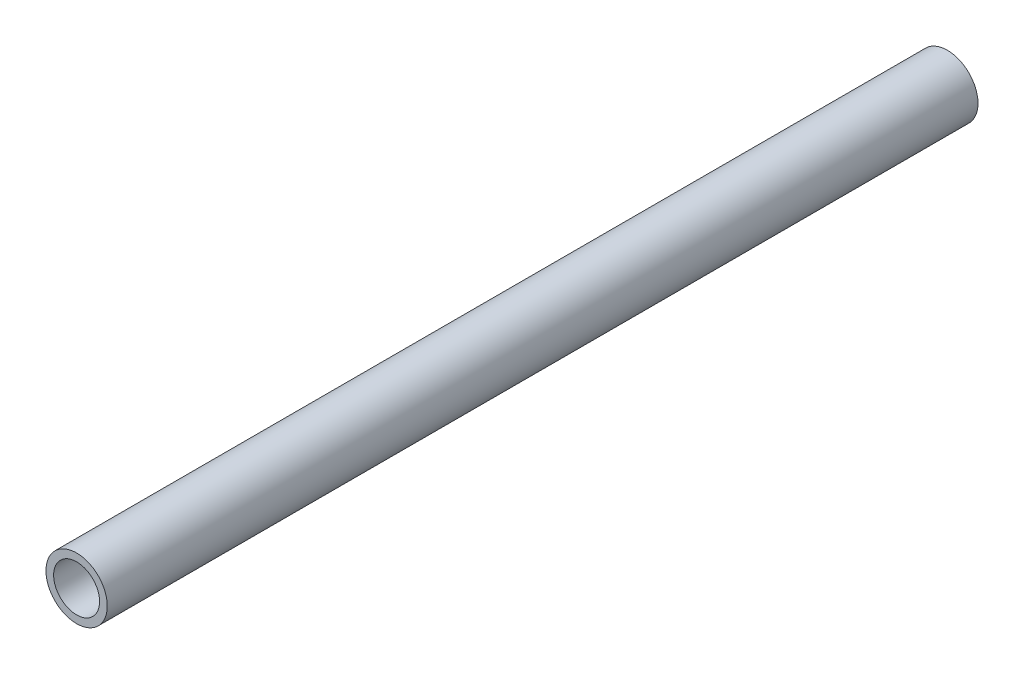
ISO-10303-21;
HEADER;
FILE_DESCRIPTION(('STEP AP214'),'2;1');
FILE_NAME('part.step','',(''),(''),'','','');
FILE_SCHEMA(('AUTOMOTIVE_DESIGN { 1 0 10303 214 1 1 1 1 }'));
ENDSEC;
DATA;
#1=APPLICATION_CONTEXT('core data for automotive mechanical design processes');
#2=APPLICATION_PROTOCOL_DEFINITION('international standard','automotive_design',2000,#1);
#3=PRODUCT_CONTEXT('',#1,'mechanical');
#4=PRODUCT('Part','Part','',(#3));
#5=PRODUCT_RELATED_PRODUCT_CATEGORY('part','',(#4));
#6=PRODUCT_DEFINITION_FORMATION('','',#4);
#7=PRODUCT_DEFINITION_CONTEXT('part definition',#1,'design');
#8=PRODUCT_DEFINITION('design','',#6,#7);
#9=PRODUCT_DEFINITION_SHAPE('','',#8);
#10=(LENGTH_UNIT() NAMED_UNIT(*) SI_UNIT(.MILLI.,.METRE.));
#11=(NAMED_UNIT(*) PLANE_ANGLE_UNIT() SI_UNIT($,.RADIAN.));
#12=(NAMED_UNIT(*) SI_UNIT($,.STERADIAN.) SOLID_ANGLE_UNIT());
#13=UNCERTAINTY_MEASURE_WITH_UNIT(LENGTH_MEASURE(1.E-05),#10,'distance_accuracy_value','');
#14=(GEOMETRIC_REPRESENTATION_CONTEXT(3) GLOBAL_UNCERTAINTY_ASSIGNED_CONTEXT((#13)) GLOBAL_UNIT_ASSIGNED_CONTEXT((#10,
#11,#12)) REPRESENTATION_CONTEXT('',''));
#15=CARTESIAN_POINT('',(0.,0.,0.));
#16=DIRECTION('',(0.,0.,1.));
#17=DIRECTION('',(1.,0.,0.));
#18=AXIS2_PLACEMENT_3D('',#15,#16,#17);
#19=CARTESIAN_POINT('',(0.,0.,180.366666666667));
#20=DIRECTION('',(0.,0.,1.));
#21=DIRECTION('',(1.,0.,0.));
#22=AXIS2_PLACEMENT_3D('',#19,#20,#21);
#23=PLANE('',#22);
#24=CARTESIAN_POINT('',(0.,0.,180.366666666667));
#25=DIRECTION('',(0.,0.,1.));
#26=DIRECTION('',(1.,0.,0.));
#27=AXIS2_PLACEMENT_3D('',#24,#25,#26);
#28=CIRCLE('',#27,6.35);
#29=CARTESIAN_POINT('',(6.35,0.,180.366666666667));
#30=VERTEX_POINT('',#29);
#31=EDGE_CURVE('E10',#30,#30,#28,.T.);
#32=ORIENTED_EDGE('',*,*,#31,.T.);
#33=EDGE_LOOP('',(#32));
#34=FACE_BOUND('',#33,.T.);
#35=CARTESIAN_POINT('',(0.,0.,180.366666666667));
#36=DIRECTION('',(0.,0.,1.));
#37=DIRECTION('',(1.,0.,0.));
#38=AXIS2_PLACEMENT_3D('',#35,#36,#37);
#39=CIRCLE('',#38,4.7625);
#40=CARTESIAN_POINT('',(4.7625,0.,180.366666666667));
#41=VERTEX_POINT('',#40);
#42=EDGE_CURVE('E43',#41,#41,#39,.T.);
#43=ORIENTED_EDGE('',*,*,#42,.F.);
#44=EDGE_LOOP('',(#43));
#45=FACE_BOUND('',#44,.T.);
#46=ADVANCED_FACE('F32',(#34,#45),#23,.T.);
#47=CARTESIAN_POINT('',(0.,0.,0.));
#48=DIRECTION('',(0.,0.,1.));
#49=DIRECTION('',(1.,0.,0.));
#50=AXIS2_PLACEMENT_3D('',#47,#48,#49);
#51=PLANE('',#50);
#52=CARTESIAN_POINT('',(0.,0.,0.));
#53=DIRECTION('',(0.,0.,1.));
#54=DIRECTION('',(1.,0.,0.));
#55=AXIS2_PLACEMENT_3D('',#52,#53,#54);
#56=CIRCLE('',#55,6.35);
#57=CARTESIAN_POINT('',(6.35,0.,0.));
#58=VERTEX_POINT('',#57);
#59=EDGE_CURVE('E36',#58,#58,#56,.T.);
#60=ORIENTED_EDGE('',*,*,#59,.F.);
#61=EDGE_LOOP('',(#60));
#62=FACE_BOUND('',#61,.T.);
#63=CARTESIAN_POINT('',(0.,0.,0.));
#64=DIRECTION('',(0.,0.,1.));
#65=DIRECTION('',(1.,0.,0.));
#66=AXIS2_PLACEMENT_3D('',#63,#64,#65);
#67=CIRCLE('',#66,4.7625);
#68=CARTESIAN_POINT('',(4.7625,0.,0.));
#69=VERTEX_POINT('',#68);
#70=EDGE_CURVE('E45',#69,#69,#67,.T.);
#71=ORIENTED_EDGE('',*,*,#70,.T.);
#72=EDGE_LOOP('',(#71));
#73=FACE_BOUND('',#72,.T.);
#74=ADVANCED_FACE('F55',(#62,#73),#51,.F.);
#75=CARTESIAN_POINT('',(0.,0.,180.366666666667));
#76=DIRECTION('',(0.,0.,-1.));
#77=DIRECTION('',(-1.,0.,0.));
#78=AXIS2_PLACEMENT_3D('',#75,#76,#77);
#79=CYLINDRICAL_SURFACE('',#78,6.35);
#80=ORIENTED_EDGE('',*,*,#31,.F.);
#81=EDGE_LOOP('',(#80));
#82=FACE_BOUND('',#81,.T.);
#83=ORIENTED_EDGE('',*,*,#59,.T.);
#84=EDGE_LOOP('',(#83));
#85=FACE_BOUND('',#84,.T.);
#86=ADVANCED_FACE('F34',(#82,#85),#79,.T.);
#87=CARTESIAN_POINT('',(0.,0.,180.366666666667));
#88=DIRECTION('',(0.,0.,-1.));
#89=DIRECTION('',(-1.,0.,0.));
#90=AXIS2_PLACEMENT_3D('',#87,#88,#89);
#91=CYLINDRICAL_SURFACE('',#90,4.7625);
#92=ORIENTED_EDGE('',*,*,#42,.T.);
#93=EDGE_LOOP('',(#92));
#94=FACE_BOUND('',#93,.T.);
#95=ORIENTED_EDGE('',*,*,#70,.F.);
#96=EDGE_LOOP('',(#95));
#97=FACE_BOUND('',#96,.T.);
#98=ADVANCED_FACE('F51',(#94,#97),#91,.F.);
#99=CLOSED_SHELL('',(#46,#74,#86,#98));
#100=MANIFOLD_SOLID_BREP('B2',#99);
#101=ADVANCED_BREP_SHAPE_REPRESENTATION('',(#18,#100),#14);
#102=SHAPE_DEFINITION_REPRESENTATION(#9,#101);
ENDSEC;
END-ISO-10303-21;
